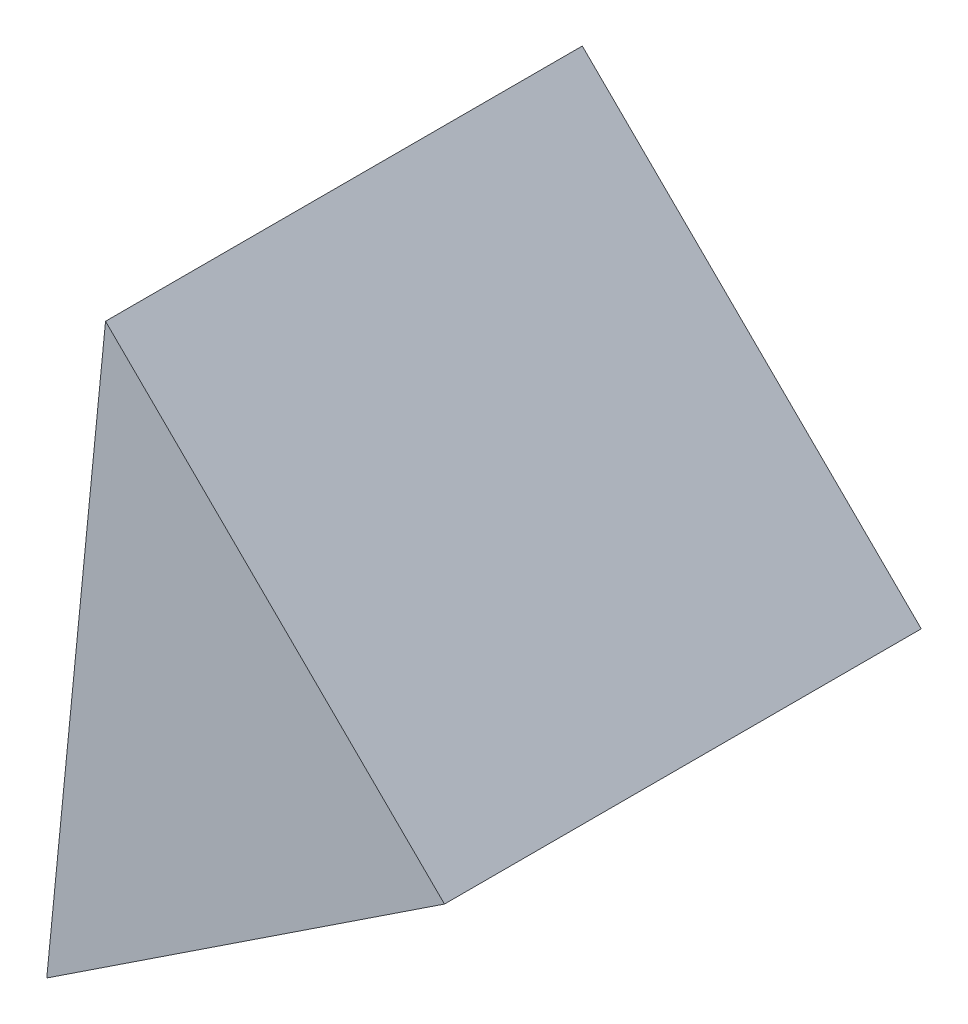
ISO-10303-21;
HEADER;
FILE_DESCRIPTION(('STEP AP214'),'2;1');
FILE_NAME('part.step','',(''),(''),'','','');
FILE_SCHEMA(('AUTOMOTIVE_DESIGN { 1 0 10303 214 1 1 1 1 }'));
ENDSEC;
DATA;
#1=APPLICATION_CONTEXT('core data for automotive mechanical design processes');
#2=APPLICATION_PROTOCOL_DEFINITION('international standard','automotive_design',2000,#1);
#3=PRODUCT_CONTEXT('',#1,'mechanical');
#4=PRODUCT('Part','Part','',(#3));
#5=PRODUCT_RELATED_PRODUCT_CATEGORY('part','',(#4));
#6=PRODUCT_DEFINITION_FORMATION('','',#4);
#7=PRODUCT_DEFINITION_CONTEXT('part definition',#1,'design');
#8=PRODUCT_DEFINITION('design','',#6,#7);
#9=PRODUCT_DEFINITION_SHAPE('','',#8);
#10=(LENGTH_UNIT() NAMED_UNIT(*) SI_UNIT(.MILLI.,.METRE.));
#11=(NAMED_UNIT(*) PLANE_ANGLE_UNIT() SI_UNIT($,.RADIAN.));
#12=(NAMED_UNIT(*) SI_UNIT($,.STERADIAN.) SOLID_ANGLE_UNIT());
#13=UNCERTAINTY_MEASURE_WITH_UNIT(LENGTH_MEASURE(1.E-05),#10,'distance_accuracy_value','');
#14=(GEOMETRIC_REPRESENTATION_CONTEXT(3) GLOBAL_UNCERTAINTY_ASSIGNED_CONTEXT((#13)) GLOBAL_UNIT_ASSIGNED_CONTEXT((#10,
#11,#12)) REPRESENTATION_CONTEXT('',''));
#15=CARTESIAN_POINT('',(0.,0.,0.));
#16=DIRECTION('',(0.,0.,1.));
#17=DIRECTION('',(1.,0.,0.));
#18=AXIS2_PLACEMENT_3D('',#15,#16,#17);
#19=CARTESIAN_POINT('',(13.1997707903264,9.11849399507506,15.));
#20=DIRECTION('',(-0.551401526003401,0.834239987726026,0.));
#21=DIRECTION('',(-0.834239987726026,-0.551401526003401,0.));
#22=AXIS2_PLACEMENT_3D('',#19,#20,#21);
#23=PLANE('',#22);
#24=DIRECTION('',(0.834239987726026,0.551401526003401,0.));
#25=VECTOR('',#24,1.);
#26=CARTESIAN_POINT('',(13.1997707903264,9.11849399507506,0.));
#27=LINE('',#26,#25);
#28=CARTESIAN_POINT('',(0.686170974436035,0.847471105024041,0.));
#29=VERTEX_POINT('',#28);
#30=CARTESIAN_POINT('',(13.1997707903264,9.11849399507506,0.));
#31=VERTEX_POINT('',#30);
#32=EDGE_CURVE('E82',#29,#31,#27,.T.);
#33=ORIENTED_EDGE('',*,*,#32,.T.);
#34=DIRECTION('',(0.,0.,-1.));
#35=VECTOR('',#34,1.);
#36=CARTESIAN_POINT('',(13.1997707903264,9.11849399507506,15.));
#37=LINE('',#36,#35);
#38=CARTESIAN_POINT('',(13.1997707903264,9.11849399507506,15.));
#39=VERTEX_POINT('',#38);
#40=EDGE_CURVE('E11',#39,#31,#37,.T.);
#41=ORIENTED_EDGE('',*,*,#40,.F.);
#42=DIRECTION('',(0.834239987726026,0.551401526003401,0.));
#43=VECTOR('',#42,1.);
#44=CARTESIAN_POINT('',(13.1997707903264,9.11849399507506,15.));
#45=LINE('',#44,#43);
#46=CARTESIAN_POINT('',(0.686170974436035,0.847471105024041,15.));
#47=VERTEX_POINT('',#46);
#48=EDGE_CURVE('E75',#47,#39,#45,.T.);
#49=ORIENTED_EDGE('',*,*,#48,.F.);
#50=DIRECTION('',(0.,0.,-1.));
#51=VECTOR('',#50,1.);
#52=CARTESIAN_POINT('',(0.686170974436035,0.847471105024041,15.));
#53=LINE('',#52,#51);
#54=EDGE_CURVE('E83',#47,#29,#53,.T.);
#55=ORIENTED_EDGE('',*,*,#54,.T.);
#56=EDGE_LOOP('',(#33,#41,#49,#55));
#57=FACE_BOUND('',#56,.T.);
#58=ADVANCED_FACE('F35',(#57),#23,.F.);
#59=CARTESIAN_POINT('',(13.1997707903264,9.11849399507506,15.));
#60=DIRECTION('',(-0.703219485005664,-0.710972823607463,0.));
#61=DIRECTION('',(0.710972823607463,-0.703219485005664,0.));
#62=AXIS2_PLACEMENT_3D('',#59,#60,#61);
#63=PLANE('',#62);
#64=DIRECTION('',(-0.710972823607463,0.703219485005664,0.));
#65=VECTOR('',#64,1.);
#66=CARTESIAN_POINT('',(13.1997707903264,9.11849399507506,0.));
#67=LINE('',#66,#65);
#68=CARTESIAN_POINT('',(2.53517843621449,19.66678627016,0.));
#69=VERTEX_POINT('',#68);
#70=EDGE_CURVE('E63',#31,#69,#67,.T.);
#71=ORIENTED_EDGE('',*,*,#70,.T.);
#72=DIRECTION('',(0.,0.,-1.));
#73=VECTOR('',#72,1.);
#74=CARTESIAN_POINT('',(2.53517843621449,19.66678627016,15.));
#75=LINE('',#74,#73);
#76=CARTESIAN_POINT('',(2.53517843621449,19.66678627016,15.));
#77=VERTEX_POINT('',#76);
#78=EDGE_CURVE('E43',#77,#69,#75,.T.);
#79=ORIENTED_EDGE('',*,*,#78,.F.);
#80=DIRECTION('',(-0.710972823607463,0.703219485005664,0.));
#81=VECTOR('',#80,1.);
#82=CARTESIAN_POINT('',(13.1997707903264,9.11849399507506,15.));
#83=LINE('',#82,#81);
#84=EDGE_CURVE('E71',#39,#77,#83,.T.);
#85=ORIENTED_EDGE('',*,*,#84,.F.);
#86=ORIENTED_EDGE('',*,*,#40,.T.);
#87=EDGE_LOOP('',(#71,#79,#85,#86));
#88=FACE_BOUND('',#87,.T.);
#89=ADVANCED_FACE('F72',(#88),#63,.F.);
#90=CARTESIAN_POINT('',(0.686170974436035,0.847471105024041,15.));
#91=DIRECTION('',(0.995208082962371,-0.0977797095841538,0.));
#92=DIRECTION('',(0.0977797095841538,0.995208082962372,0.));
#93=AXIS2_PLACEMENT_3D('',#90,#91,#92);
#94=PLANE('',#93);
#95=DIRECTION('',(-0.0977797095841538,-0.995208082962371,0.));
#96=VECTOR('',#95,1.);
#97=CARTESIAN_POINT('',(0.686170974436035,0.847471105024041,0.));
#98=LINE('',#97,#96);
#99=EDGE_CURVE('E68',#69,#29,#98,.T.);
#100=ORIENTED_EDGE('',*,*,#99,.T.);
#101=ORIENTED_EDGE('',*,*,#54,.F.);
#102=DIRECTION('',(-0.0977797095841538,-0.995208082962371,0.));
#103=VECTOR('',#102,1.);
#104=CARTESIAN_POINT('',(0.686170974436035,0.847471105024041,15.));
#105=LINE('',#104,#103);
#106=EDGE_CURVE('E51',#77,#47,#105,.T.);
#107=ORIENTED_EDGE('',*,*,#106,.F.);
#108=ORIENTED_EDGE('',*,*,#78,.T.);
#109=EDGE_LOOP('',(#100,#101,#107,#108));
#110=FACE_BOUND('',#109,.T.);
#111=ADVANCED_FACE('F90',(#110),#94,.F.);
#112=CARTESIAN_POINT('',(0.,0.,15.));
#113=DIRECTION('',(0.,0.,-1.));
#114=DIRECTION('',(-1.,0.,0.));
#115=AXIS2_PLACEMENT_3D('',#112,#113,#114);
#116=PLANE('',#115);
#117=ORIENTED_EDGE('',*,*,#48,.T.);
#118=ORIENTED_EDGE('',*,*,#84,.T.);
#119=ORIENTED_EDGE('',*,*,#106,.T.);
#120=EDGE_LOOP('',(#117,#118,#119));
#121=FACE_BOUND('',#120,.T.);
#122=ADVANCED_FACE('F78',(#121),#116,.F.);
#123=CARTESIAN_POINT('',(0.,0.,0.));
#124=DIRECTION('',(0.,0.,-1.));
#125=DIRECTION('',(-1.,0.,0.));
#126=AXIS2_PLACEMENT_3D('',#123,#124,#125);
#127=PLANE('',#126);
#128=ORIENTED_EDGE('',*,*,#32,.F.);
#129=ORIENTED_EDGE('',*,*,#99,.F.);
#130=ORIENTED_EDGE('',*,*,#70,.F.);
#131=EDGE_LOOP('',(#128,#129,#130));
#132=FACE_BOUND('',#131,.T.);
#133=ADVANCED_FACE('F91',(#132),#127,.T.);
#134=CLOSED_SHELL('',(#58,#89,#111,#122,#133));
#135=MANIFOLD_SOLID_BREP('B2',#134);
#136=ADVANCED_BREP_SHAPE_REPRESENTATION('',(#18,#135),#14);
#137=SHAPE_DEFINITION_REPRESENTATION(#9,#136);
ENDSEC;
END-ISO-10303-21;
